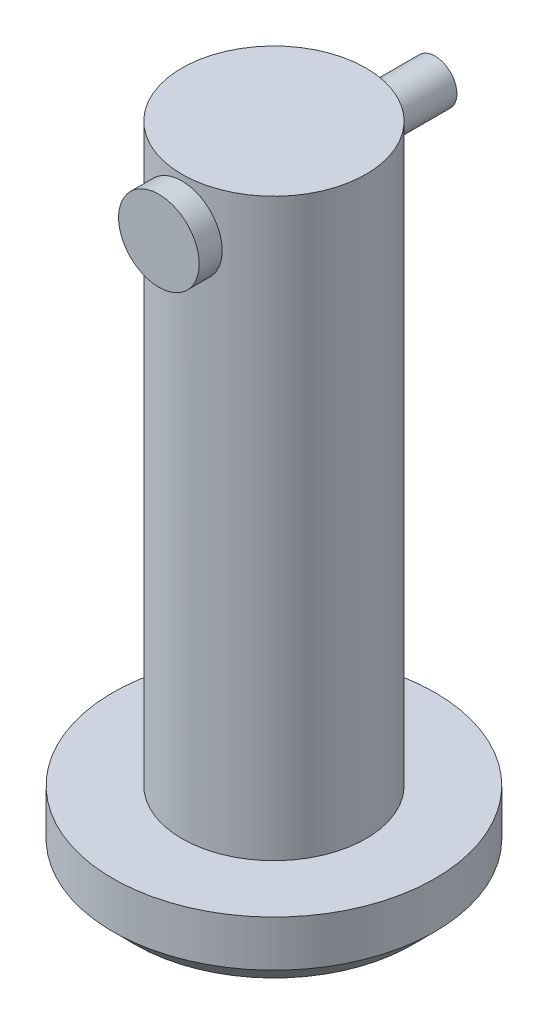
ISO-10303-21;
HEADER;
FILE_DESCRIPTION(('STEP AP214'),'2;1');
FILE_NAME('part.step','',(''),(''),'','','');
FILE_SCHEMA(('AUTOMOTIVE_DESIGN { 1 0 10303 214 1 1 1 1 }'));
ENDSEC;
DATA;
#1=APPLICATION_CONTEXT('core data for automotive mechanical design processes');
#2=APPLICATION_PROTOCOL_DEFINITION('international standard','automotive_design',2000,#1);
#3=PRODUCT_CONTEXT('',#1,'mechanical');
#4=PRODUCT('Part','Part','',(#3));
#5=PRODUCT_RELATED_PRODUCT_CATEGORY('part','',(#4));
#6=PRODUCT_DEFINITION_FORMATION('','',#4);
#7=PRODUCT_DEFINITION_CONTEXT('part definition',#1,'design');
#8=PRODUCT_DEFINITION('design','',#6,#7);
#9=PRODUCT_DEFINITION_SHAPE('','',#8);
#10=(LENGTH_UNIT() NAMED_UNIT(*) SI_UNIT(.MILLI.,.METRE.));
#11=(NAMED_UNIT(*) PLANE_ANGLE_UNIT() SI_UNIT($,.RADIAN.));
#12=(NAMED_UNIT(*) SI_UNIT($,.STERADIAN.) SOLID_ANGLE_UNIT());
#13=UNCERTAINTY_MEASURE_WITH_UNIT(LENGTH_MEASURE(1.E-05),#10,'distance_accuracy_value','');
#14=(GEOMETRIC_REPRESENTATION_CONTEXT(3) GLOBAL_UNCERTAINTY_ASSIGNED_CONTEXT((#13)) GLOBAL_UNIT_ASSIGNED_CONTEXT((#10,
#11,#12)) REPRESENTATION_CONTEXT('',''));
#15=CARTESIAN_POINT('',(0.,0.,0.));
#16=DIRECTION('',(0.,0.,1.));
#17=DIRECTION('',(1.,0.,0.));
#18=AXIS2_PLACEMENT_3D('',#15,#16,#17);
#19=CARTESIAN_POINT('',(0.,23.,-7.));
#20=DIRECTION('',(0.,0.,1.));
#21=DIRECTION('',(1.,0.,0.));
#22=AXIS2_PLACEMENT_3D('',#19,#20,#21);
#23=CYLINDRICAL_SURFACE('',#22,0.95);
#24=CARTESIAN_POINT('',(0.,23.,-7.));
#25=DIRECTION('',(0.,0.,1.));
#26=DIRECTION('',(1.,0.,0.));
#27=AXIS2_PLACEMENT_3D('',#24,#25,#26);
#28=CIRCLE('',#27,0.95);
#29=CARTESIAN_POINT('',(0.95,23.,-7.));
#30=VERTEX_POINT('',#29);
#31=EDGE_CURVE('E11',#30,#30,#28,.T.);
#32=ORIENTED_EDGE('',*,*,#31,.T.);
#33=EDGE_LOOP('',(#32));
#34=FACE_BOUND('',#33,.T.);
#35=CARTESIAN_POINT('',(0.,23.,4.));
#36=DIRECTION('',(0.,0.,1.));
#37=DIRECTION('',(1.,0.,0.));
#38=AXIS2_PLACEMENT_3D('',#35,#36,#37);
#39=CIRCLE('',#38,0.95);
#40=CARTESIAN_POINT('',(0.95,23.,4.));
#41=VERTEX_POINT('',#40);
#42=EDGE_CURVE('E44',#41,#41,#39,.F.);
#43=ORIENTED_EDGE('',*,*,#42,.T.);
#44=EDGE_LOOP('',(#43));
#45=FACE_BOUND('',#44,.T.);
#46=ADVANCED_FACE('F41',(#34,#45),#23,.T.);
#47=CARTESIAN_POINT('',(0.,23.,-7.));
#48=DIRECTION('',(0.,0.,1.));
#49=DIRECTION('',(1.,0.,0.));
#50=AXIS2_PLACEMENT_3D('',#47,#48,#49);
#51=PLANE('',#50);
#52=ORIENTED_EDGE('',*,*,#31,.F.);
#53=EDGE_LOOP('',(#52));
#54=FACE_BOUND('',#53,.T.);
#55=ADVANCED_FACE('F73',(#54),#51,.F.);
#56=CARTESIAN_POINT('',(0.,23.,4.));
#57=DIRECTION('',(0.,0.,1.));
#58=DIRECTION('',(1.,0.,0.));
#59=AXIS2_PLACEMENT_3D('',#56,#57,#58);
#60=CYLINDRICAL_SURFACE('',#59,1.75);
#61=CARTESIAN_POINT('',(0.,23.,4.));
#62=DIRECTION('',(0.,0.,1.));
#63=DIRECTION('',(1.,0.,0.));
#64=AXIS2_PLACEMENT_3D('',#61,#62,#63);
#65=CIRCLE('',#64,1.75);
#66=CARTESIAN_POINT('',(1.75,23.,4.));
#67=VERTEX_POINT('',#66);
#68=EDGE_CURVE('E51',#67,#67,#65,.T.);
#69=ORIENTED_EDGE('',*,*,#68,.T.);
#70=EDGE_LOOP('',(#69));
#71=FACE_BOUND('',#70,.T.);
#72=CARTESIAN_POINT('',(0.,23.,5.));
#73=DIRECTION('',(0.,0.,1.));
#74=DIRECTION('',(1.,0.,0.));
#75=AXIS2_PLACEMENT_3D('',#72,#73,#74);
#76=CIRCLE('',#75,1.75);
#77=CARTESIAN_POINT('',(1.75,23.,5.));
#78=VERTEX_POINT('',#77);
#79=EDGE_CURVE('E53',#78,#78,#76,.T.);
#80=ORIENTED_EDGE('',*,*,#79,.F.);
#81=EDGE_LOOP('',(#80));
#82=FACE_BOUND('',#81,.T.);
#83=ADVANCED_FACE('F59',(#71,#82),#60,.T.);
#84=CARTESIAN_POINT('',(0.,23.,4.));
#85=DIRECTION('',(0.,0.,1.));
#86=DIRECTION('',(1.,0.,0.));
#87=AXIS2_PLACEMENT_3D('',#84,#85,#86);
#88=PLANE('',#87);
#89=ORIENTED_EDGE('',*,*,#42,.F.);
#90=EDGE_LOOP('',(#89));
#91=FACE_BOUND('',#90,.T.);
#92=ORIENTED_EDGE('',*,*,#68,.F.);
#93=EDGE_LOOP('',(#92));
#94=FACE_BOUND('',#93,.T.);
#95=ADVANCED_FACE('F62',(#91,#94),#88,.F.);
#96=CARTESIAN_POINT('',(0.,23.,5.));
#97=DIRECTION('',(0.,0.,1.));
#98=DIRECTION('',(1.,0.,0.));
#99=AXIS2_PLACEMENT_3D('',#96,#97,#98);
#100=PLANE('',#99);
#101=ORIENTED_EDGE('',*,*,#79,.T.);
#102=EDGE_LOOP('',(#101));
#103=FACE_BOUND('',#102,.T.);
#104=ADVANCED_FACE('F64',(#103),#100,.T.);
#105=CLOSED_SHELL('',(#46,#55,#83,#95,#104));
#106=MANIFOLD_SOLID_BREP('B2',#105);
#107=CARTESIAN_POINT('',(0.,25.,0.));
#108=DIRECTION('',(0.,-1.,0.));
#109=DIRECTION('',(0.,0.,-1.));
#110=AXIS2_PLACEMENT_3D('',#107,#108,#109);
#111=CYLINDRICAL_SURFACE('',#110,4.);
#112=CARTESIAN_POINT('',(0.,25.,0.));
#113=DIRECTION('',(0.,1.,0.));
#114=DIRECTION('',(0.,0.,1.));
#115=AXIS2_PLACEMENT_3D('',#112,#113,#114);
#116=CIRCLE('',#115,4.);
#117=CARTESIAN_POINT('',(0.,25.,4.));
#118=VERTEX_POINT('',#117);
#119=EDGE_CURVE('E131',#118,#118,#116,.T.);
#120=ORIENTED_EDGE('',*,*,#119,.F.);
#121=EDGE_LOOP('',(#120));
#122=FACE_BOUND('',#121,.T.);
#123=CARTESIAN_POINT('',(0.,0.,0.));
#124=DIRECTION('',(0.,-1.,0.));
#125=DIRECTION('',(0.,0.,-1.));
#126=AXIS2_PLACEMENT_3D('',#123,#124,#125);
#127=CIRCLE('',#126,4.);
#128=CARTESIAN_POINT('',(0.,0.,-4.));
#129=VERTEX_POINT('',#128);
#130=EDGE_CURVE('E165',#129,#129,#127,.T.);
#131=ORIENTED_EDGE('',*,*,#130,.F.);
#132=EDGE_LOOP('',(#131));
#133=FACE_BOUND('',#132,.T.);
#134=CARTESIAN_POINT('',(-1.,23.,3.87298334620742));
#135=CARTESIAN_POINT('',(-0.9999984314387,22.9447796996432,3.87298440057185));
#136=CARTESIAN_POINT('',(-0.99541049820807,22.8895420405686,3.87417722499278));
#137=CARTESIAN_POINT('',(-0.977209250194447,22.7806529687674,3.87880744892249));
#138=CARTESIAN_POINT('',(-0.963590682698078,22.72700249822,3.8822461547418));
#139=CARTESIAN_POINT('',(-0.927796479849635,22.6228785847122,3.89095489813012));
#140=CARTESIAN_POINT('',(-0.905631891140944,22.5724011378422,3.8962225706936));
#141=CARTESIAN_POINT('',(-0.853408456505407,22.4758756589875,3.90799276818327));
#142=CARTESIAN_POINT('',(-0.823349275424506,22.4298278151689,3.91449534553241));
#143=CARTESIAN_POINT('',(-0.755483370924518,22.3424553418942,3.92816286540368));
#144=CARTESIAN_POINT('',(-0.717534755081558,22.3012425598597,3.93533839048709));
#145=CARTESIAN_POINT('',(-0.635272825640328,22.2256954422561,3.94945150206622));
#146=CARTESIAN_POINT('',(-0.59095891767214,22.1913617497514,3.95638906626691));
#147=CARTESIAN_POINT('',(-0.496458080431565,22.1300898129474,3.96936166208095));
#148=CARTESIAN_POINT('',(-0.446197830478043,22.1032614447354,3.975382749602));
#149=CARTESIAN_POINT('',(-0.341705273717109,22.0584761423388,3.9857232477043));
#150=CARTESIAN_POINT('',(-0.287473554316776,22.0405178992338,3.99004290933747));
#151=CARTESIAN_POINT('',(-0.177743503501662,22.0143408661686,3.99641903539262));
#152=CARTESIAN_POINT('',(-0.122293087819589,22.0059321422694,3.99851957537723));
#153=CARTESIAN_POINT('',(-0.010731527705107,21.9984966482898,4.00037437642922));
#154=CARTESIAN_POINT('',(0.0453795178152283,21.9994684911162,4.00012898438682));
#155=CARTESIAN_POINT('',(0.155352247172388,22.0106299401001,3.99735237981413));
#156=CARTESIAN_POINT('',(0.209236215601068,22.0206145300215,3.99487200936349));
#157=CARTESIAN_POINT('',(0.314538247413687,22.0491885080194,3.98796334609942));
#158=CARTESIAN_POINT('',(0.365956179370439,22.067778354151,3.98353494959376));
#159=CARTESIAN_POINT('',(0.465406703501808,22.1132010282748,3.97315003880358));
#160=CARTESIAN_POINT('',(0.513404509766506,22.1401068178647,3.96718007878021));
#161=CARTESIAN_POINT('',(0.60427562234049,22.2013422716465,3.9543596152386));
#162=CARTESIAN_POINT('',(0.647148035085507,22.2356732274242,3.94750895860996));
#163=CARTESIAN_POINT('',(0.727774035084958,22.3118834967929,3.93345485507808));
#164=CARTESIAN_POINT('',(0.765357679075201,22.3539419569391,3.92624687810367));
#165=CARTESIAN_POINT('',(0.83297637596302,22.4438399894161,3.91246017406682));
#166=CARTESIAN_POINT('',(0.863011076046018,22.4916798317964,3.90588147642388));
#167=CARTESIAN_POINT('',(0.914788129022599,22.5921160136596,3.89408198732659));
#168=CARTESIAN_POINT('',(0.936489566970492,22.6447342921253,3.88886793490288));
#169=CARTESIAN_POINT('',(0.970685620636342,22.7530341872306,3.88047456055983));
#170=CARTESIAN_POINT('',(0.983182206552911,22.8087151455933,3.87729480324087));
#171=CARTESIAN_POINT('',(0.998331855466071,22.9199838006093,3.87342142415656));
#172=CARTESIAN_POINT('',(1.00123618956785,22.9755351173319,3.87266435637459));
#173=CARTESIAN_POINT('',(0.997806796206219,23.0863287746313,3.87354937392416));
#174=CARTESIAN_POINT('',(0.991473919139521,23.1415711431805,3.87519123840506));
#175=CARTESIAN_POINT('',(0.969970185575065,23.2492457059819,3.88062832781824));
#176=CARTESIAN_POINT('',(0.954945627312698,23.3017090906283,3.8843878809375));
#177=CARTESIAN_POINT('',(0.916647232668248,23.4033725831407,3.89360287308385));
#178=CARTESIAN_POINT('',(0.893372419085019,23.4525723036221,3.89905851299445));
#179=CARTESIAN_POINT('',(0.838708267174624,23.5473765111469,3.91118454837305));
#180=CARTESIAN_POINT('',(0.807168701534252,23.5928915360172,3.91787667442657));
#181=CARTESIAN_POINT('',(0.737060292934456,23.6780753451205,3.93166833228686));
#182=CARTESIAN_POINT('',(0.69849029480544,23.71774316666,3.93876793091388));
#183=CARTESIAN_POINT('',(0.614262720984726,23.7911244170284,3.95278961212642));
#184=CARTESIAN_POINT('',(0.568451952531594,23.8246640250195,3.95970280824734));
#185=CARTESIAN_POINT('',(0.471702682694676,23.8835743467805,3.97238886645494));
#186=CARTESIAN_POINT('',(0.420764448957591,23.9089454866433,3.97816178801584));
#187=CARTESIAN_POINT('',(0.31555820173109,23.9505784138112,3.98788046295326));
#188=CARTESIAN_POINT('',(0.261317381027881,23.9669057137516,3.99183932008964));
#189=CARTESIAN_POINT('',(0.150749760318808,23.9901841338434,3.99754117358315));
#190=CARTESIAN_POINT('',(0.0944233650412436,23.9971370634956,3.99928459757363));
#191=CARTESIAN_POINT('',(-0.0170835264433265,24.0013675895755,4.00034169408811));
#192=CARTESIAN_POINT('',(-0.0722538269660333,23.9989017090954,3.99971978880008));
#193=CARTESIAN_POINT('',(-0.18136749641474,23.9849521727057,3.99625896457423));
#194=CARTESIAN_POINT('',(-0.235310901780888,23.9734687849869,3.99342011157094));
#195=CARTESIAN_POINT('',(-0.340171035644817,23.9419477802291,3.98585432853963));
#196=CARTESIAN_POINT('',(-0.391102494581019,23.9219565466854,3.98113764502668));
#197=CARTESIAN_POINT('',(-0.488917053041468,23.8740294209807,3.97031288913382));
#198=CARTESIAN_POINT('',(-0.535799641265051,23.8460925273304,3.96420464137727));
#199=CARTESIAN_POINT('',(-0.625401928423902,23.7822847660029,3.95107249681342));
#200=CARTESIAN_POINT('',(-0.667994988300589,23.7462398570926,3.94403016945646));
#201=CARTESIAN_POINT('',(-0.746615020271254,23.6675771480262,3.92990649053207));
#202=CARTESIAN_POINT('',(-0.782640325068179,23.6249576839021,3.92282512952424));
#203=CARTESIAN_POINT('',(-0.84776202647924,23.5333985857987,3.90927475860683));
#204=CARTESIAN_POINT('',(-0.876716619446592,23.4843558765875,3.90281963730391));
#205=CARTESIAN_POINT('',(-0.925926896615621,23.3819445100772,3.8914395555011));
#206=CARTESIAN_POINT('',(-0.946188909759557,23.3285790338927,3.88651348244814));
#207=CARTESIAN_POINT('',(-0.974422528565572,23.2294229881737,3.87951908741315));
#208=CARTESIAN_POINT('',(-0.98399317059583,23.1841068356176,3.87708663005761));
#209=CARTESIAN_POINT('',(-0.99678229257282,23.0925311309985,3.87381838580358));
#210=CARTESIAN_POINT('',(-1.00000131437052,23.0462716597494,3.87298246270639));
#211=CARTESIAN_POINT('',(-1.,23.,3.87298334620742));
#212=B_SPLINE_CURVE_WITH_KNOTS('',3,(#134,#135,#136,#137,#138,#139,#140,#141,#142,#143,#144,
#145,#146,#147,#148,#149,#150,#151,#152,#153,#154,#155,#156,#157,#158,#159,#160,#161,#162,#163,
#164,#165,#166,#167,#168,#169,#170,#171,#172,#173,#174,#175,#176,#177,#178,#179,#180,#181,#182,
#183,#184,#185,#186,#187,#188,#189,#190,#191,#192,#193,#194,#195,#196,#197,#198,#199,#200,#201,
#202,#203,#204,#205,#206,#207,#208,#209,#210,#211),.UNSPECIFIED.,.T.,.F.,(4,2,2,2,2,2,2,2,2,2,2,
2,2,2,2,2,2,2,2,2,2,2,2,2,2,2,2,2,2,2,2,2,2,2,2,2,2,2,4),(0.,0.16549097667523,0.331078296534212,
0.496452290829153,0.66183330698466,0.830495816734651,0.999174085882213,1.17020598555443,
1.34121263935112,1.50875500394413,1.67627259462683,1.84007305071853,2.00388222686189,
2.16917149698053,2.3344895418384,2.50428186625039,2.67408212476196,2.84470572799636,
3.01529280048094,3.18137429900962,3.34744050869796,3.51078961999958,3.67415808564842,
3.84073138339938,4.00733207550293,4.17810132382402,4.34886166284096,4.51836829119047,
4.6878421955989,4.85273378447258,5.01762046947067,5.18161950620159,5.34563922291504,
5.51358838629103,5.68158012622478,5.85270590910145,6.02370688542923,6.16239130867207,
6.30106390036083),.UNSPECIFIED.);
#213=CARTESIAN_POINT('',(-1.,23.,3.87298334620742));
#214=VERTEX_POINT('',#213);
#215=EDGE_CURVE('E134',#214,#214,#212,.T.);
#216=ORIENTED_EDGE('',*,*,#215,.F.);
#217=EDGE_LOOP('',(#216));
#218=FACE_BOUND('',#217,.T.);
#219=CARTESIAN_POINT('',(0.,24.,-4.));
#220=CARTESIAN_POINT('',(0.0552507257798205,23.9999984495079,-3.99999906578675));
#221=CARTESIAN_POINT('',(0.110518771887175,23.9954056328175,-3.99884385421219));
#222=CARTESIAN_POINT('',(0.219470882513688,23.977183232462,-3.99434742553261));
#223=CARTESIAN_POINT('',(0.27315403124716,23.9635485269748,-3.99100496946646));
#224=CARTESIAN_POINT('',(0.377347248121718,23.9277071643586,-3.98250417554693));
#225=CARTESIAN_POINT('',(0.427861042286669,23.9055108008565,-3.97734801894725));
#226=CARTESIAN_POINT('',(0.524448087936285,23.8532124066368,-3.96576895871729));
#227=CARTESIAN_POINT('',(0.57052118956584,23.823110109254,-3.95934601236034));
#228=CARTESIAN_POINT('',(0.657867951533946,23.7551994735639,-3.94578275727868));
#229=CARTESIAN_POINT('',(0.69903712670738,23.7172589500272,-3.93863138099022));
#230=CARTESIAN_POINT('',(0.774499284802202,23.6350318633941,-3.92449080078353));
#231=CARTESIAN_POINT('',(0.808791491299423,23.5907445847023,-3.91750161525566));
#232=CARTESIAN_POINT('',(0.870017695199355,23.4962698488417,-3.9043651713314));
#233=CARTESIAN_POINT('',(0.896834810616905,23.4460045127931,-3.89823196313737));
#234=CARTESIAN_POINT('',(0.941597939033685,23.3415010588944,-3.88766329874815));
#235=CARTESIAN_POINT('',(0.959545370292889,23.2872635777828,-3.88322757115193));
#236=CARTESIAN_POINT('',(0.985703224536194,23.1775043345317,-3.87666984478367));
#237=CARTESIAN_POINT('',(0.994101512222227,23.1220300693001,-3.87450327383617));
#238=CARTESIAN_POINT('',(1.00150785004524,23.0104209539907,-3.8725957502516));
#239=CARTESIAN_POINT('',(1.00051742787865,22.9542862128676,-3.87285440299096));
#240=CARTESIAN_POINT('',(0.989324349759521,22.8443894615037,-3.87572803664412));
#241=CARTESIAN_POINT('',(0.979345560127014,22.7906029190233,-3.87828575334586));
#242=CARTESIAN_POINT('',(0.950816124602072,22.6854926327258,-3.88537806450989));
#243=CARTESIAN_POINT('',(0.932264868046283,22.6341690646473,-3.88991279980464));
#244=CARTESIAN_POINT('',(0.88692631862477,22.5348413224986,-3.90050075936124));
#245=CARTESIAN_POINT('',(0.860057778155276,22.4868758854736,-3.90656884979614));
#246=CARTESIAN_POINT('',(0.798904184009971,22.3960541934954,-3.91953140564257));
#247=CARTESIAN_POINT('',(0.764617832539226,22.3531988346218,-3.9264260155649));
#248=CARTESIAN_POINT('',(0.688442283120811,22.2725309228704,-3.94050587026521));
#249=CARTESIAN_POINT('',(0.646364172110573,22.2348970066258,-3.94769379651981));
#250=CARTESIAN_POINT('',(0.556407945002467,22.1671858383574,-3.96137310385857));
#251=CARTESIAN_POINT('',(0.508529651805297,22.1371088171576,-3.96786446366277));
#252=CARTESIAN_POINT('',(0.408077259120928,22.0852996091837,-3.97945154729455));
#253=CARTESIAN_POINT('',(0.355487595472415,22.0635964398304,-3.9845424008515));
#254=CARTESIAN_POINT('',(0.247250672095254,22.0293884628603,-3.99271944660946));
#255=CARTESIAN_POINT('',(0.191603999433655,22.0168818957212,-3.99580602226187));
#256=CARTESIAN_POINT('',(0.0803599802600161,22.0016949562941,-3.9995699951425));
#257=CARTESIAN_POINT('',(0.0247978133254715,21.9987713159498,-4.00030702338852));
#258=CARTESIAN_POINT('',(-0.0860219165343399,22.0021660013703,-3.999458698763));
#259=CARTESIAN_POINT('',(-0.141279506429731,22.0084834951994,-3.99787355494564));
#260=CARTESIAN_POINT('',(-0.249076179184328,22.0299806055943,-3.99259720751571));
#261=CARTESIAN_POINT('',(-0.301643412645836,22.0450275089847,-3.98893756123874));
#262=CARTESIAN_POINT('',(-0.403504861635007,22.0834047226856,-3.97992471089423));
#263=CARTESIAN_POINT('',(-0.452798746021757,22.1067358695421,-3.97457133579928));
#264=CARTESIAN_POINT('',(-0.547682089619898,22.1614907525832,-3.96262205284207));
#265=CARTESIAN_POINT('',(-0.59319029455722,22.1930507415978,-3.95600578244621));
#266=CARTESIAN_POINT('',(-0.678351075762164,22.2631932725313,-3.94229672791613));
#267=CARTESIAN_POINT('',(-0.71800263931534,22.3017770264113,-3.93520386167803));
#268=CARTESIAN_POINT('',(-0.791327045381822,22.3860013072296,-3.92112637973847));
#269=CARTESIAN_POINT('',(-0.824829245081355,22.4317918020016,-3.91414869458187));
#270=CARTESIAN_POINT('',(-0.883673839341799,22.5284884229771,-3.90128585584826));
#271=CARTESIAN_POINT('',(-0.909016596105291,22.5793943219732,-3.89540065378017));
#272=CARTESIAN_POINT('',(-0.950634280406195,22.6846038149421,-3.88545396489777));
#273=CARTESIAN_POINT('',(-0.966962931102711,22.7388850855627,-3.88138170194604));
#274=CARTESIAN_POINT('',(-0.990230439969187,22.8495397585927,-3.87551162726789));
#275=CARTESIAN_POINT('',(-0.997171351652439,22.9059127006883,-3.87371331813291));
#276=CARTESIAN_POINT('',(-1.00135906022266,23.0174140159035,-3.87263267469304));
#277=CARTESIAN_POINT('',(-0.998878598520079,23.0725316234165,-3.87327955152176));
#278=CARTESIAN_POINT('',(-0.984918185541912,23.1815359257787,-3.87685272671895));
#279=CARTESIAN_POINT('',(-0.973438415124514,23.2354226453424,-3.87977897927904));
#280=CARTESIAN_POINT('',(-0.941954212961864,23.3401389727103,-3.88754173788482));
#281=CARTESIAN_POINT('',(-0.922000936453585,23.3909848701601,-3.89236676824206));
#282=CARTESIAN_POINT('',(-0.874176609070048,23.4886435884758,-3.90338503816552));
#283=CARTESIAN_POINT('',(-0.846304460022793,23.5354558487913,-3.90957846747182));
#284=CARTESIAN_POINT('',(-0.782578499091425,23.6250364193347,-3.92283756175675));
#285=CARTESIAN_POINT('',(-0.746535441941504,23.6676673822826,-3.92992176554505));
#286=CARTESIAN_POINT('',(-0.667859580793158,23.7463646965303,-3.94405351497524));
#287=CARTESIAN_POINT('',(-0.625225214174097,23.782429486742,-3.95110105151373));
#288=CARTESIAN_POINT('',(-0.533645057801727,23.8476075390431,-3.96451770431775));
#289=CARTESIAN_POINT('',(-0.484598948210924,23.8765830757811,-3.97087222243912));
#290=CARTESIAN_POINT('',(-0.382177373006984,23.9258316419604,-3.98203283316746));
#291=CARTESIAN_POINT('',(-0.32880504229116,23.946110907099,-3.98684003466521));
#292=CARTESIAN_POINT('',(-0.229606835495648,23.9743812202198,-3.99365373043694));
#293=CARTESIAN_POINT('',(-0.184253447272046,23.983967495369,-3.9960172336846));
#294=CARTESIAN_POINT('',(-0.092604047690856,23.996777295748,-3.99919070154632));
#295=CARTESIAN_POINT('',(-0.0463081074950778,24.0000012995369,-4.00000078300596));
#296=CARTESIAN_POINT('',(0.,24.,-4.));
#297=B_SPLINE_CURVE_WITH_KNOTS('',3,(#219,#220,#221,#222,#223,#224,#225,#226,#227,#228,#229,
#230,#231,#232,#233,#234,#235,#236,#237,#238,#239,#240,#241,#242,#243,#244,#245,#246,#247,#248,
#249,#250,#251,#252,#253,#254,#255,#256,#257,#258,#259,#260,#261,#262,#263,#264,#265,#266,#267,
#268,#269,#270,#271,#272,#273,#274,#275,#276,#277,#278,#279,#280,#281,#282,#283,#284,#285,#286,
#287,#288,#289,#290,#291,#292,#293,#294,#295,#296),.UNSPECIFIED.,.T.,.F.,(4,2,2,2,2,2,2,2,2,2,2,
2,2,2,2,2,2,2,2,2,2,2,2,2,2,2,2,2,2,2,2,2,2,2,2,2,2,2,4),(0.,0.165582474981259,
0.331258825175933,0.496736601524071,0.662219960112886,0.830762902914258,0.999324863867077,
1.17039098363871,1.34142974112912,1.50904196732954,1.67662692075132,1.84014998004679,
2.00368468977359,2.16887018582586,2.33408460557442,2.50401000646013,2.67394059705498,
2.84445486006076,3.01493649125762,3.18105539299518,3.34715934075162,3.51080183009358,
3.67446084881527,3.84102391710235,4.0076157533868,4.17829672802984,4.34897012499673,
4.51861503076025,4.68822282168272,4.85295853599075,5.0176909397069,5.18144267039632,
5.34521712091268,5.51326384273274,5.68135046513612,5.85248123666392,6.02348909214234,
6.16228161961433,6.3010637069536),.UNSPECIFIED.);
#298=CARTESIAN_POINT('',(0.,24.,-4.));
#299=VERTEX_POINT('',#298);
#300=EDGE_CURVE('E119',#299,#299,#297,.T.);
#301=ORIENTED_EDGE('',*,*,#300,.F.);
#302=EDGE_LOOP('',(#301));
#303=FACE_BOUND('',#302,.T.);
#304=ADVANCED_FACE('F115',(#122,#133,#218,#303),#111,.T.);
#305=CARTESIAN_POINT('',(0.,25.,0.));
#306=DIRECTION('',(0.,1.,0.));
#307=DIRECTION('',(0.,0.,1.));
#308=AXIS2_PLACEMENT_3D('',#305,#306,#307);
#309=PLANE('',#308);
#310=ORIENTED_EDGE('',*,*,#119,.T.);
#311=EDGE_LOOP('',(#310));
#312=FACE_BOUND('',#311,.T.);
#313=ADVANCED_FACE('F156',(#312),#309,.T.);
#314=CARTESIAN_POINT('',(0.,-3.,0.));
#315=DIRECTION('',(0.,1.,0.));
#316=DIRECTION('',(0.,0.,1.));
#317=AXIS2_PLACEMENT_3D('',#314,#315,#316);
#318=CYLINDRICAL_SURFACE('',#317,7.);
#319=CARTESIAN_POINT('',(0.,-1.99999999999999,0.));
#320=DIRECTION('',(0.,-1.,0.));
#321=DIRECTION('',(0.,0.,-1.));
#322=AXIS2_PLACEMENT_3D('',#319,#320,#321);
#323=CIRCLE('',#322,7.);
#324=CARTESIAN_POINT('',(0.,-1.99999999999999,-7.));
#325=VERTEX_POINT('',#324);
#326=EDGE_CURVE('E40',#325,#325,#323,.F.);
#327=ORIENTED_EDGE('',*,*,#326,.T.);
#328=EDGE_LOOP('',(#327));
#329=FACE_BOUND('',#328,.T.);
#330=CARTESIAN_POINT('',(0.,0.,0.));
#331=DIRECTION('',(0.,-1.,0.));
#332=DIRECTION('',(0.,0.,-1.));
#333=AXIS2_PLACEMENT_3D('',#330,#331,#332);
#334=CIRCLE('',#333,7.);
#335=CARTESIAN_POINT('',(0.,0.,-7.));
#336=VERTEX_POINT('',#335);
#337=EDGE_CURVE('E167',#336,#336,#334,.T.);
#338=ORIENTED_EDGE('',*,*,#337,.T.);
#339=EDGE_LOOP('',(#338));
#340=FACE_BOUND('',#339,.T.);
#341=ADVANCED_FACE('F150',(#329,#340),#318,.T.);
#342=CARTESIAN_POINT('',(0.,-3.,0.));
#343=DIRECTION('',(0.,-1.,0.));
#344=DIRECTION('',(0.,0.,-1.));
#345=AXIS2_PLACEMENT_3D('',#342,#343,#344);
#346=PLANE('',#345);
#347=CARTESIAN_POINT('',(0.,-3.,0.));
#348=DIRECTION('',(0.,-1.,0.));
#349=DIRECTION('',(0.,0.,-1.));
#350=AXIS2_PLACEMENT_3D('',#347,#348,#349);
#351=CIRCLE('',#350,6.);
#352=CARTESIAN_POINT('',(0.,-3.,-6.));
#353=VERTEX_POINT('',#352);
#354=EDGE_CURVE('E126',#353,#353,#351,.T.);
#355=ORIENTED_EDGE('',*,*,#354,.T.);
#356=EDGE_LOOP('',(#355));
#357=FACE_BOUND('',#356,.T.);
#358=ADVANCED_FACE('F145',(#357),#346,.T.);
#359=CARTESIAN_POINT('',(0.,0.,0.));
#360=DIRECTION('',(0.,-1.,0.));
#361=DIRECTION('',(0.,0.,-1.));
#362=AXIS2_PLACEMENT_3D('',#359,#360,#361);
#363=PLANE('',#362);
#364=ORIENTED_EDGE('',*,*,#130,.T.);
#365=EDGE_LOOP('',(#364));
#366=FACE_BOUND('',#365,.T.);
#367=ORIENTED_EDGE('',*,*,#337,.F.);
#368=EDGE_LOOP('',(#367));
#369=FACE_BOUND('',#368,.T.);
#370=ADVANCED_FACE('F149',(#366,#369),#363,.F.);
#371=CARTESIAN_POINT('',(0.,-3.,0.));
#372=DIRECTION('',(0.,1.,0.));
#373=DIRECTION('',(0.,0.,1.));
#374=AXIS2_PLACEMENT_3D('',#371,#372,#373);
#375=CONICAL_SURFACE('',#374,6.,0.785398163397447);
#376=ORIENTED_EDGE('',*,*,#326,.F.);
#377=EDGE_LOOP('',(#376));
#378=FACE_BOUND('',#377,.T.);
#379=ORIENTED_EDGE('',*,*,#354,.F.);
#380=EDGE_LOOP('',(#379));
#381=FACE_BOUND('',#380,.T.);
#382=ADVANCED_FACE('F117',(#378,#381),#375,.T.);
#383=CARTESIAN_POINT('',(0.,23.,10.));
#384=DIRECTION('',(0.,0.,-1.));
#385=DIRECTION('',(-1.,0.,0.));
#386=AXIS2_PLACEMENT_3D('',#383,#384,#385);
#387=CYLINDRICAL_SURFACE('',#386,1.);
#388=ORIENTED_EDGE('',*,*,#215,.T.);
#389=EDGE_LOOP('',(#388));
#390=FACE_BOUND('',#389,.T.);
#391=ORIENTED_EDGE('',*,*,#300,.T.);
#392=EDGE_LOOP('',(#391));
#393=FACE_BOUND('',#392,.T.);
#394=ADVANCED_FACE('F140',(#390,#393),#387,.F.);
#395=CLOSED_SHELL('',(#304,#313,#341,#358,#370,#382,#394));
#396=MANIFOLD_SOLID_BREP('B6',#395);
#397=ADVANCED_BREP_SHAPE_REPRESENTATION('',(#18,#106,#396),#14);
#398=SHAPE_DEFINITION_REPRESENTATION(#9,#397);
ENDSEC;
END-ISO-10303-21;
